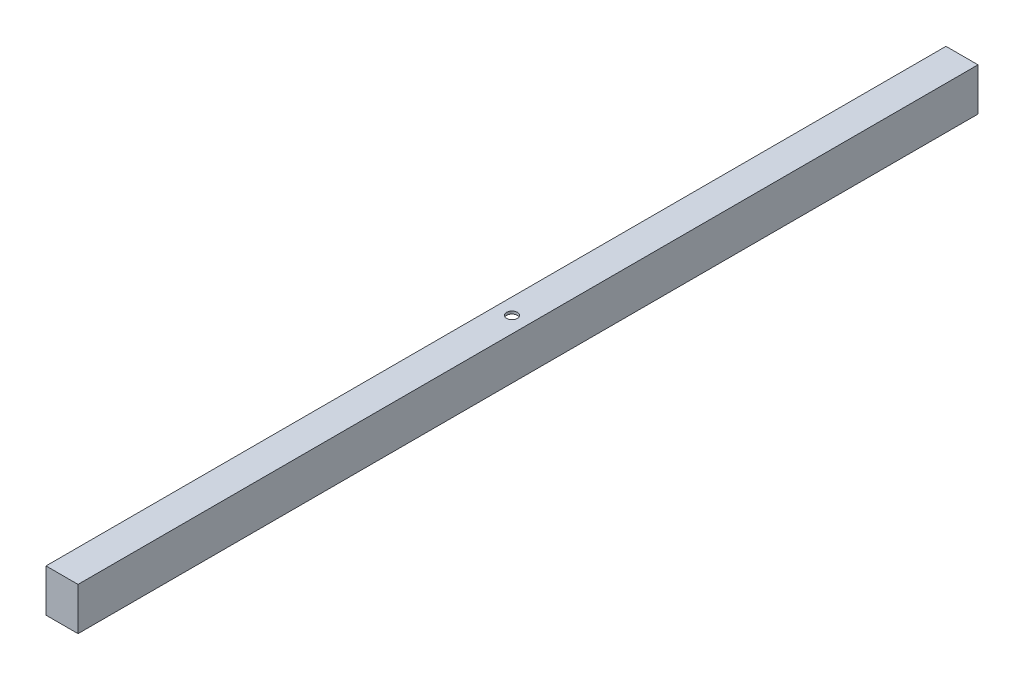
ISO-10303-21;
HEADER;
FILE_DESCRIPTION(('STEP AP214'),'2;1');
FILE_NAME('part.step','',(''),(''),'','','');
FILE_SCHEMA(('AUTOMOTIVE_DESIGN { 1 0 10303 214 1 1 1 1 }'));
ENDSEC;
DATA;
#1=APPLICATION_CONTEXT('core data for automotive mechanical design processes');
#2=APPLICATION_PROTOCOL_DEFINITION('international standard','automotive_design',2000,#1);
#3=PRODUCT_CONTEXT('',#1,'mechanical');
#4=PRODUCT('Part','Part','',(#3));
#5=PRODUCT_RELATED_PRODUCT_CATEGORY('part','',(#4));
#6=PRODUCT_DEFINITION_FORMATION('','',#4);
#7=PRODUCT_DEFINITION_CONTEXT('part definition',#1,'design');
#8=PRODUCT_DEFINITION('design','',#6,#7);
#9=PRODUCT_DEFINITION_SHAPE('','',#8);
#10=(LENGTH_UNIT() NAMED_UNIT(*) SI_UNIT(.MILLI.,.METRE.));
#11=(NAMED_UNIT(*) PLANE_ANGLE_UNIT() SI_UNIT($,.RADIAN.));
#12=(NAMED_UNIT(*) SI_UNIT($,.STERADIAN.) SOLID_ANGLE_UNIT());
#13=UNCERTAINTY_MEASURE_WITH_UNIT(LENGTH_MEASURE(1.E-05),#10,'distance_accuracy_value','');
#14=(GEOMETRIC_REPRESENTATION_CONTEXT(3) GLOBAL_UNCERTAINTY_ASSIGNED_CONTEXT((#13)) GLOBAL_UNIT_ASSIGNED_CONTEXT((#10,
#11,#12)) REPRESENTATION_CONTEXT('',''));
#15=CARTESIAN_POINT('',(0.,0.,0.));
#16=DIRECTION('',(0.,0.,1.));
#17=DIRECTION('',(1.,0.,0.));
#18=AXIS2_PLACEMENT_3D('',#15,#16,#17);
#19=CARTESIAN_POINT('',(0.,-23.8125,533.4));
#20=DIRECTION('',(0.,-1.,0.));
#21=DIRECTION('',(0.,0.,-1.));
#22=AXIS2_PLACEMENT_3D('',#19,#20,#21);
#23=PLANE('',#22);
#24=CARTESIAN_POINT('',(9.525,-23.8125,266.7));
#25=DIRECTION('',(0.,-1.,0.));
#26=DIRECTION('',(0.,0.,-1.));
#27=AXIS2_PLACEMENT_3D('',#24,#25,#26);
#28=CIRCLE('',#27,3.175);
#29=CARTESIAN_POINT('',(9.525,-23.8125,263.525));
#30=VERTEX_POINT('',#29);
#31=EDGE_CURVE('E144',#30,#30,#28,.T.);
#32=ORIENTED_EDGE('',*,*,#31,.F.);
#33=EDGE_LOOP('',(#32));
#34=FACE_BOUND('',#33,.T.);
#35=DIRECTION('',(0.,0.,-1.));
#36=VECTOR('',#35,1.);
#37=CARTESIAN_POINT('',(0.,-23.8125,533.4));
#38=LINE('',#37,#36);
#39=CARTESIAN_POINT('',(0.,-23.8125,534.416));
#40=VERTEX_POINT('',#39);
#41=CARTESIAN_POINT('',(0.,-23.8125,-1.016));
#42=VERTEX_POINT('',#41);
#43=EDGE_CURVE('E11',#40,#42,#38,.T.);
#44=ORIENTED_EDGE('',*,*,#43,.T.);
#45=DIRECTION('',(-1.,0.,0.));
#46=VECTOR('',#45,1.);
#47=CARTESIAN_POINT('',(19.05,-23.8125,-1.016));
#48=LINE('',#47,#46);
#49=CARTESIAN_POINT('',(19.05,-23.8125,-1.016));
#50=VERTEX_POINT('',#49);
#51=EDGE_CURVE('E130',#50,#42,#48,.T.);
#52=ORIENTED_EDGE('',*,*,#51,.F.);
#53=DIRECTION('',(0.,0.,-1.));
#54=VECTOR('',#53,1.);
#55=CARTESIAN_POINT('',(19.05,-23.8125,533.4));
#56=LINE('',#55,#54);
#57=CARTESIAN_POINT('',(19.05,-23.8125,534.416));
#58=VERTEX_POINT('',#57);
#59=EDGE_CURVE('E47',#58,#50,#56,.T.);
#60=ORIENTED_EDGE('',*,*,#59,.F.);
#61=DIRECTION('',(1.,0.,0.));
#62=VECTOR('',#61,1.);
#63=CARTESIAN_POINT('',(0.,-23.8125,534.416));
#64=LINE('',#63,#62);
#65=EDGE_CURVE('E109',#40,#58,#64,.T.);
#66=ORIENTED_EDGE('',*,*,#65,.F.);
#67=EDGE_LOOP('',(#44,#52,#60,#66));
#68=FACE_BOUND('',#67,.T.);
#69=ADVANCED_FACE('F38',(#34,#68),#23,.T.);
#70=CARTESIAN_POINT('',(19.05,0.,533.4));
#71=DIRECTION('',(1.,0.,0.));
#72=DIRECTION('',(0.,1.,0.));
#73=AXIS2_PLACEMENT_3D('',#70,#71,#72);
#74=PLANE('',#73);
#75=ORIENTED_EDGE('',*,*,#59,.T.);
#76=DIRECTION('',(0.,-1.,0.));
#77=VECTOR('',#76,1.);
#78=CARTESIAN_POINT('',(19.05,1.5875,-1.016));
#79=LINE('',#78,#77);
#80=CARTESIAN_POINT('',(19.05,1.5875,-1.016));
#81=VERTEX_POINT('',#80);
#82=EDGE_CURVE('E127',#81,#50,#79,.T.);
#83=ORIENTED_EDGE('',*,*,#82,.F.);
#84=DIRECTION('',(0.,0.,-1.));
#85=VECTOR('',#84,1.);
#86=CARTESIAN_POINT('',(19.05,1.5875,533.4));
#87=LINE('',#86,#85);
#88=CARTESIAN_POINT('',(19.05,1.5875,534.416));
#89=VERTEX_POINT('',#88);
#90=EDGE_CURVE('E176',#89,#81,#87,.T.);
#91=ORIENTED_EDGE('',*,*,#90,.F.);
#92=DIRECTION('',(0.,1.,0.));
#93=VECTOR('',#92,1.);
#94=CARTESIAN_POINT('',(19.05,1.5875,534.416));
#95=LINE('',#94,#93);
#96=EDGE_CURVE('E113',#58,#89,#95,.T.);
#97=ORIENTED_EDGE('',*,*,#96,.F.);
#98=EDGE_LOOP('',(#75,#83,#91,#97));
#99=FACE_BOUND('',#98,.T.);
#100=ADVANCED_FACE('F180',(#99),#74,.T.);
#101=CARTESIAN_POINT('',(0.,1.5875,533.4));
#102=DIRECTION('',(0.,1.,0.));
#103=DIRECTION('',(0.,0.,1.));
#104=AXIS2_PLACEMENT_3D('',#101,#102,#103);
#105=PLANE('',#104);
#106=CARTESIAN_POINT('',(9.525,1.5875,266.7));
#107=DIRECTION('',(0.,1.,0.));
#108=DIRECTION('',(0.,0.,1.));
#109=AXIS2_PLACEMENT_3D('',#106,#107,#108);
#110=CIRCLE('',#109,3.175);
#111=CARTESIAN_POINT('',(9.525,1.5875,269.875));
#112=VERTEX_POINT('',#111);
#113=EDGE_CURVE('E136',#112,#112,#110,.T.);
#114=ORIENTED_EDGE('',*,*,#113,.F.);
#115=EDGE_LOOP('',(#114));
#116=FACE_BOUND('',#115,.T.);
#117=ORIENTED_EDGE('',*,*,#90,.T.);
#118=DIRECTION('',(1.,0.,0.));
#119=VECTOR('',#118,1.);
#120=CARTESIAN_POINT('',(19.05,1.5875,-1.016));
#121=LINE('',#120,#119);
#122=CARTESIAN_POINT('',(0.,1.5875,-1.016));
#123=VERTEX_POINT('',#122);
#124=EDGE_CURVE('E133',#123,#81,#121,.T.);
#125=ORIENTED_EDGE('',*,*,#124,.F.);
#126=DIRECTION('',(0.,0.,-1.));
#127=VECTOR('',#126,1.);
#128=CARTESIAN_POINT('',(0.,1.5875,533.4));
#129=LINE('',#128,#127);
#130=CARTESIAN_POINT('',(0.,1.5875,534.416));
#131=VERTEX_POINT('',#130);
#132=EDGE_CURVE('E174',#131,#123,#129,.T.);
#133=ORIENTED_EDGE('',*,*,#132,.F.);
#134=DIRECTION('',(-1.,0.,0.));
#135=VECTOR('',#134,1.);
#136=CARTESIAN_POINT('',(0.,1.5875,534.416));
#137=LINE('',#136,#135);
#138=EDGE_CURVE('E118',#89,#131,#137,.T.);
#139=ORIENTED_EDGE('',*,*,#138,.F.);
#140=EDGE_LOOP('',(#117,#125,#133,#139));
#141=FACE_BOUND('',#140,.T.);
#142=ADVANCED_FACE('F185',(#116,#141),#105,.T.);
#143=CARTESIAN_POINT('',(0.,0.,533.4));
#144=DIRECTION('',(-1.,0.,0.));
#145=DIRECTION('',(0.,0.,1.));
#146=AXIS2_PLACEMENT_3D('',#143,#144,#145);
#147=PLANE('',#146);
#148=DIRECTION('',(0.,-1.,0.));
#149=VECTOR('',#148,1.);
#150=CARTESIAN_POINT('',(0.,1.5875,533.4));
#151=LINE('',#150,#149);
#152=CARTESIAN_POINT('',(0.,0.,533.4));
#153=VERTEX_POINT('',#152);
#154=CARTESIAN_POINT('',(0.,-22.225,533.4));
#155=VERTEX_POINT('',#154);
#156=EDGE_CURVE('E119',#153,#155,#151,.T.);
#157=ORIENTED_EDGE('',*,*,#156,.T.);
#158=DIRECTION('',(0.,0.,-1.));
#159=VECTOR('',#158,1.);
#160=CARTESIAN_POINT('',(0.,-22.225,533.4));
#161=LINE('',#160,#159);
#162=CARTESIAN_POINT('',(0.,-22.225,0.));
#163=VERTEX_POINT('',#162);
#164=EDGE_CURVE('E158',#155,#163,#161,.T.);
#165=ORIENTED_EDGE('',*,*,#164,.T.);
#166=DIRECTION('',(0.,1.,0.));
#167=VECTOR('',#166,1.);
#168=CARTESIAN_POINT('',(0.,1.5875,0.));
#169=LINE('',#168,#167);
#170=CARTESIAN_POINT('',(0.,0.,0.));
#171=VERTEX_POINT('',#170);
#172=EDGE_CURVE('E125',#163,#171,#169,.T.);
#173=ORIENTED_EDGE('',*,*,#172,.T.);
#174=DIRECTION('',(0.,0.,-1.));
#175=VECTOR('',#174,1.);
#176=CARTESIAN_POINT('',(0.,0.,533.4));
#177=LINE('',#176,#175);
#178=EDGE_CURVE('E171',#153,#171,#177,.T.);
#179=ORIENTED_EDGE('',*,*,#178,.F.);
#180=EDGE_LOOP('',(#157,#165,#173,#179));
#181=FACE_BOUND('',#180,.T.);
#182=ORIENTED_EDGE('',*,*,#132,.T.);
#183=DIRECTION('',(0.,1.,0.));
#184=VECTOR('',#183,1.);
#185=CARTESIAN_POINT('',(0.,1.5875,-1.016));
#186=LINE('',#185,#184);
#187=EDGE_CURVE('E104',#42,#123,#186,.T.);
#188=ORIENTED_EDGE('',*,*,#187,.F.);
#189=ORIENTED_EDGE('',*,*,#43,.F.);
#190=DIRECTION('',(0.,-1.,0.));
#191=VECTOR('',#190,1.);
#192=CARTESIAN_POINT('',(0.,1.5875,534.416));
#193=LINE('',#192,#191);
#194=EDGE_CURVE('E102',#131,#40,#193,.T.);
#195=ORIENTED_EDGE('',*,*,#194,.F.);
#196=EDGE_LOOP('',(#182,#188,#189,#195));
#197=FACE_BOUND('',#196,.T.);
#198=ADVANCED_FACE('F100',(#181,#197),#147,.T.);
#199=CARTESIAN_POINT('',(0.,0.,533.4));
#200=DIRECTION('',(0.,1.,0.));
#201=DIRECTION('',(0.,0.,1.));
#202=AXIS2_PLACEMENT_3D('',#199,#200,#201);
#203=PLANE('',#202);
#204=CARTESIAN_POINT('',(9.525,0.,266.7));
#205=DIRECTION('',(0.,1.,0.));
#206=DIRECTION('',(0.,0.,1.));
#207=AXIS2_PLACEMENT_3D('',#204,#205,#206);
#208=CIRCLE('',#207,3.175);
#209=CARTESIAN_POINT('',(9.525,0.,269.875));
#210=VERTEX_POINT('',#209);
#211=EDGE_CURVE('E141',#210,#210,#208,.T.);
#212=ORIENTED_EDGE('',*,*,#211,.T.);
#213=EDGE_LOOP('',(#212));
#214=FACE_BOUND('',#213,.T.);
#215=DIRECTION('',(1.,0.,0.));
#216=VECTOR('',#215,1.);
#217=CARTESIAN_POINT('',(0.,0.,0.));
#218=LINE('',#217,#216);
#219=CARTESIAN_POINT('',(17.4625,0.,0.));
#220=VERTEX_POINT('',#219);
#221=EDGE_CURVE('E147',#171,#220,#218,.T.);
#222=ORIENTED_EDGE('',*,*,#221,.T.);
#223=DIRECTION('',(0.,0.,-1.));
#224=VECTOR('',#223,1.);
#225=CARTESIAN_POINT('',(17.4625,0.,533.4));
#226=LINE('',#225,#224);
#227=CARTESIAN_POINT('',(17.4625,0.,533.4));
#228=VERTEX_POINT('',#227);
#229=EDGE_CURVE('E168',#228,#220,#226,.T.);
#230=ORIENTED_EDGE('',*,*,#229,.F.);
#231=DIRECTION('',(1.,0.,0.));
#232=VECTOR('',#231,1.);
#233=CARTESIAN_POINT('',(0.,0.,533.4));
#234=LINE('',#233,#232);
#235=EDGE_CURVE('E148',#153,#228,#234,.T.);
#236=ORIENTED_EDGE('',*,*,#235,.F.);
#237=ORIENTED_EDGE('',*,*,#178,.T.);
#238=EDGE_LOOP('',(#222,#230,#236,#237));
#239=FACE_BOUND('',#238,.T.);
#240=ADVANCED_FACE('F193',(#214,#239),#203,.F.);
#241=CARTESIAN_POINT('',(17.4625,0.,533.4));
#242=DIRECTION('',(1.,0.,0.));
#243=DIRECTION('',(0.,1.,0.));
#244=AXIS2_PLACEMENT_3D('',#241,#242,#243);
#245=PLANE('',#244);
#246=DIRECTION('',(0.,-1.,0.));
#247=VECTOR('',#246,1.);
#248=CARTESIAN_POINT('',(17.4625,0.,0.));
#249=LINE('',#248,#247);
#250=CARTESIAN_POINT('',(17.4625,-22.225,0.));
#251=VERTEX_POINT('',#250);
#252=EDGE_CURVE('E161',#220,#251,#249,.T.);
#253=ORIENTED_EDGE('',*,*,#252,.T.);
#254=DIRECTION('',(0.,0.,-1.));
#255=VECTOR('',#254,1.);
#256=CARTESIAN_POINT('',(17.4625,-22.225,533.4));
#257=LINE('',#256,#255);
#258=CARTESIAN_POINT('',(17.4625,-22.225,533.4));
#259=VERTEX_POINT('',#258);
#260=EDGE_CURVE('E54',#259,#251,#257,.T.);
#261=ORIENTED_EDGE('',*,*,#260,.F.);
#262=DIRECTION('',(0.,-1.,0.));
#263=VECTOR('',#262,1.);
#264=CARTESIAN_POINT('',(17.4625,0.,533.4));
#265=LINE('',#264,#263);
#266=EDGE_CURVE('E151',#228,#259,#265,.T.);
#267=ORIENTED_EDGE('',*,*,#266,.F.);
#268=ORIENTED_EDGE('',*,*,#229,.T.);
#269=EDGE_LOOP('',(#253,#261,#267,#268));
#270=FACE_BOUND('',#269,.T.);
#271=ADVANCED_FACE('F214',(#270),#245,.F.);
#272=CARTESIAN_POINT('',(0.,-22.225,533.4));
#273=DIRECTION('',(0.,-1.,0.));
#274=DIRECTION('',(1.,0.,0.));
#275=AXIS2_PLACEMENT_3D('',#272,#273,#274);
#276=PLANE('',#275);
#277=CARTESIAN_POINT('',(9.525,-22.225,266.7));
#278=DIRECTION('',(0.,-1.,0.));
#279=DIRECTION('',(1.,0.,0.));
#280=AXIS2_PLACEMENT_3D('',#277,#278,#279);
#281=CIRCLE('',#280,3.175);
#282=CARTESIAN_POINT('',(12.7,-22.225,266.7));
#283=VERTEX_POINT('',#282);
#284=EDGE_CURVE('E41',#283,#283,#281,.T.);
#285=ORIENTED_EDGE('',*,*,#284,.T.);
#286=EDGE_LOOP('',(#285));
#287=FACE_BOUND('',#286,.T.);
#288=DIRECTION('',(-1.,0.,0.));
#289=VECTOR('',#288,1.);
#290=CARTESIAN_POINT('',(0.,-22.225,0.));
#291=LINE('',#290,#289);
#292=EDGE_CURVE('E152',#251,#163,#291,.T.);
#293=ORIENTED_EDGE('',*,*,#292,.T.);
#294=ORIENTED_EDGE('',*,*,#164,.F.);
#295=DIRECTION('',(-1.,0.,0.));
#296=VECTOR('',#295,1.);
#297=CARTESIAN_POINT('',(0.,-22.225,533.4));
#298=LINE('',#297,#296);
#299=EDGE_CURVE('E155',#259,#155,#298,.T.);
#300=ORIENTED_EDGE('',*,*,#299,.F.);
#301=ORIENTED_EDGE('',*,*,#260,.T.);
#302=EDGE_LOOP('',(#293,#294,#300,#301));
#303=FACE_BOUND('',#302,.T.);
#304=ADVANCED_FACE('F207',(#287,#303),#276,.F.);
#305=CARTESIAN_POINT('',(9.525,-379.4125,266.7));
#306=DIRECTION('',(0.,1.,0.));
#307=DIRECTION('',(0.,0.,1.));
#308=AXIS2_PLACEMENT_3D('',#305,#306,#307);
#309=CYLINDRICAL_SURFACE('',#308,3.175);
#310=ORIENTED_EDGE('',*,*,#31,.T.);
#311=EDGE_LOOP('',(#310));
#312=FACE_BOUND('',#311,.T.);
#313=ORIENTED_EDGE('',*,*,#284,.F.);
#314=EDGE_LOOP('',(#313));
#315=FACE_BOUND('',#314,.T.);
#316=ADVANCED_FACE('F203',(#312,#315),#309,.F.);
#317=ORIENTED_EDGE('',*,*,#113,.T.);
#318=EDGE_LOOP('',(#317));
#319=FACE_BOUND('',#318,.T.);
#320=ORIENTED_EDGE('',*,*,#211,.F.);
#321=EDGE_LOOP('',(#320));
#322=FACE_BOUND('',#321,.T.);
#323=ADVANCED_FACE('F206',(#319,#322),#309,.F.);
#324=CARTESIAN_POINT('',(0.,0.,-1.016));
#325=DIRECTION('',(0.,0.,-1.));
#326=DIRECTION('',(-1.,0.,0.));
#327=AXIS2_PLACEMENT_3D('',#324,#325,#326);
#328=PLANE('',#327);
#329=ORIENTED_EDGE('',*,*,#82,.T.);
#330=ORIENTED_EDGE('',*,*,#51,.T.);
#331=ORIENTED_EDGE('',*,*,#187,.T.);
#332=ORIENTED_EDGE('',*,*,#124,.T.);
#333=EDGE_LOOP('',(#329,#330,#331,#332));
#334=FACE_BOUND('',#333,.T.);
#335=ADVANCED_FACE('F182',(#334),#328,.T.);
#336=CARTESIAN_POINT('',(0.,0.,0.));
#337=DIRECTION('',(0.,0.,-1.));
#338=DIRECTION('',(-1.,0.,0.));
#339=AXIS2_PLACEMENT_3D('',#336,#337,#338);
#340=PLANE('',#339);
#341=ORIENTED_EDGE('',*,*,#292,.F.);
#342=ORIENTED_EDGE('',*,*,#252,.F.);
#343=ORIENTED_EDGE('',*,*,#221,.F.);
#344=ORIENTED_EDGE('',*,*,#172,.F.);
#345=EDGE_LOOP('',(#341,#342,#343,#344));
#346=FACE_BOUND('',#345,.T.);
#347=ADVANCED_FACE('F218',(#346),#340,.F.);
#348=CARTESIAN_POINT('',(0.,0.,533.4));
#349=DIRECTION('',(0.,0.,1.));
#350=DIRECTION('',(1.,0.,0.));
#351=AXIS2_PLACEMENT_3D('',#348,#349,#350);
#352=PLANE('',#351);
#353=ORIENTED_EDGE('',*,*,#156,.F.);
#354=ORIENTED_EDGE('',*,*,#235,.T.);
#355=ORIENTED_EDGE('',*,*,#266,.T.);
#356=ORIENTED_EDGE('',*,*,#299,.T.);
#357=EDGE_LOOP('',(#353,#354,#355,#356));
#358=FACE_BOUND('',#357,.T.);
#359=ADVANCED_FACE('F223',(#358),#352,.F.);
#360=CARTESIAN_POINT('',(0.,0.,534.416));
#361=DIRECTION('',(0.,0.,1.));
#362=DIRECTION('',(1.,0.,0.));
#363=AXIS2_PLACEMENT_3D('',#360,#361,#362);
#364=PLANE('',#363);
#365=ORIENTED_EDGE('',*,*,#194,.T.);
#366=ORIENTED_EDGE('',*,*,#65,.T.);
#367=ORIENTED_EDGE('',*,*,#96,.T.);
#368=ORIENTED_EDGE('',*,*,#138,.T.);
#369=EDGE_LOOP('',(#365,#366,#367,#368));
#370=FACE_BOUND('',#369,.T.);
#371=ADVANCED_FACE('F116',(#370),#364,.T.);
#372=CLOSED_SHELL('',(#69,#100,#142,#198,#240,#271,#304,#316,#323,#335,#347,#359,#371));
#373=MANIFOLD_SOLID_BREP('B2',#372);
#374=ADVANCED_BREP_SHAPE_REPRESENTATION('',(#18,#373),#14);
#375=SHAPE_DEFINITION_REPRESENTATION(#9,#374);
ENDSEC;
END-ISO-10303-21;
